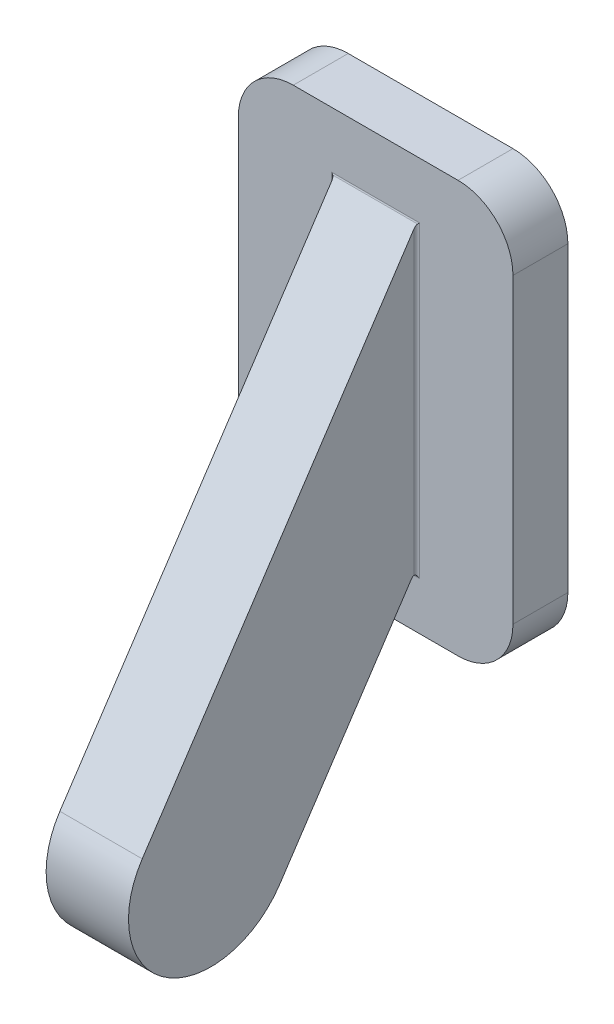
ISO-10303-21;
HEADER;
FILE_DESCRIPTION(('STEP AP214'),'2;1');
FILE_NAME('part.step','',(''),(''),'','','');
FILE_SCHEMA(('AUTOMOTIVE_DESIGN { 1 0 10303 214 1 1 1 1 }'));
ENDSEC;
DATA;
#1=APPLICATION_CONTEXT('core data for automotive mechanical design processes');
#2=APPLICATION_PROTOCOL_DEFINITION('international standard','automotive_design',2000,#1);
#3=PRODUCT_CONTEXT('',#1,'mechanical');
#4=PRODUCT('Part','Part','',(#3));
#5=PRODUCT_RELATED_PRODUCT_CATEGORY('part','',(#4));
#6=PRODUCT_DEFINITION_FORMATION('','',#4);
#7=PRODUCT_DEFINITION_CONTEXT('part definition',#1,'design');
#8=PRODUCT_DEFINITION('design','',#6,#7);
#9=PRODUCT_DEFINITION_SHAPE('','',#8);
#10=(LENGTH_UNIT() NAMED_UNIT(*) SI_UNIT(.MILLI.,.METRE.));
#11=(NAMED_UNIT(*) PLANE_ANGLE_UNIT() SI_UNIT($,.RADIAN.));
#12=(NAMED_UNIT(*) SI_UNIT($,.STERADIAN.) SOLID_ANGLE_UNIT());
#13=UNCERTAINTY_MEASURE_WITH_UNIT(LENGTH_MEASURE(1.E-05),#10,'distance_accuracy_value','');
#14=(GEOMETRIC_REPRESENTATION_CONTEXT(3) GLOBAL_UNCERTAINTY_ASSIGNED_CONTEXT((#13)) GLOBAL_UNIT_ASSIGNED_CONTEXT((#10,
#11,#12)) REPRESENTATION_CONTEXT('',''));
#15=CARTESIAN_POINT('',(0.,0.,0.));
#16=DIRECTION('',(0.,0.,1.));
#17=DIRECTION('',(1.,0.,0.));
#18=AXIS2_PLACEMENT_3D('',#15,#16,#17);
#19=CARTESIAN_POINT('',(5.,-7.5,2.));
#20=DIRECTION('',(-1.,0.,0.));
#21=DIRECTION('',(0.,0.,1.));
#22=AXIS2_PLACEMENT_3D('',#19,#20,#21);
#23=PLANE('',#22);
#24=DIRECTION('',(0.,1.,0.));
#25=VECTOR('',#24,1.);
#26=CARTESIAN_POINT('',(5.,-7.5,0.));
#27=LINE('',#26,#25);
#28=CARTESIAN_POINT('',(5.,-5.5,0.));
#29=VERTEX_POINT('',#28);
#30=CARTESIAN_POINT('',(5.,5.5,0.));
#31=VERTEX_POINT('',#30);
#32=EDGE_CURVE('E174',#29,#31,#27,.T.);
#33=ORIENTED_EDGE('',*,*,#32,.T.);
#34=DIRECTION('',(0.,0.,-1.));
#35=VECTOR('',#34,1.);
#36=CARTESIAN_POINT('',(5.,5.5,2.));
#37=LINE('',#36,#35);
#38=CARTESIAN_POINT('',(5.,5.5,2.));
#39=VERTEX_POINT('',#38);
#40=EDGE_CURVE('E269',#31,#39,#37,.F.);
#41=ORIENTED_EDGE('',*,*,#40,.T.);
#42=DIRECTION('',(0.,1.,0.));
#43=VECTOR('',#42,1.);
#44=CARTESIAN_POINT('',(5.,-7.5,2.));
#45=LINE('',#44,#43);
#46=CARTESIAN_POINT('',(5.,-5.5,2.));
#47=VERTEX_POINT('',#46);
#48=EDGE_CURVE('E196',#47,#39,#45,.T.);
#49=ORIENTED_EDGE('',*,*,#48,.F.);
#50=DIRECTION('',(0.,0.,-1.));
#51=VECTOR('',#50,1.);
#52=CARTESIAN_POINT('',(5.,-5.5,2.));
#53=LINE('',#52,#51);
#54=EDGE_CURVE('E265',#47,#29,#53,.T.);
#55=ORIENTED_EDGE('',*,*,#54,.T.);
#56=EDGE_LOOP('',(#33,#41,#49,#55));
#57=FACE_BOUND('',#56,.T.);
#58=ADVANCED_FACE('F39',(#57),#23,.F.);
#59=CARTESIAN_POINT('',(-5.,7.5,2.));
#60=DIRECTION('',(0.,-1.,0.));
#61=DIRECTION('',(0.,0.,-1.));
#62=AXIS2_PLACEMENT_3D('',#59,#60,#61);
#63=PLANE('',#62);
#64=DIRECTION('',(-1.,0.,0.));
#65=VECTOR('',#64,1.);
#66=CARTESIAN_POINT('',(-5.,7.5,0.));
#67=LINE('',#66,#65);
#68=CARTESIAN_POINT('',(3.,7.5,0.));
#69=VERTEX_POINT('',#68);
#70=CARTESIAN_POINT('',(-3.,7.5,0.));
#71=VERTEX_POINT('',#70);
#72=EDGE_CURVE('E217',#69,#71,#67,.T.);
#73=ORIENTED_EDGE('',*,*,#72,.T.);
#74=DIRECTION('',(0.,0.,-1.));
#75=VECTOR('',#74,1.);
#76=CARTESIAN_POINT('',(-3.,7.5,2.));
#77=LINE('',#76,#75);
#78=CARTESIAN_POINT('',(-3.,7.5,2.));
#79=VERTEX_POINT('',#78);
#80=EDGE_CURVE('E250',#71,#79,#77,.F.);
#81=ORIENTED_EDGE('',*,*,#80,.T.);
#82=DIRECTION('',(-1.,0.,0.));
#83=VECTOR('',#82,1.);
#84=CARTESIAN_POINT('',(-5.,7.5,2.));
#85=LINE('',#84,#83);
#86=CARTESIAN_POINT('',(3.,7.5,2.));
#87=VERTEX_POINT('',#86);
#88=EDGE_CURVE('E200',#87,#79,#85,.T.);
#89=ORIENTED_EDGE('',*,*,#88,.F.);
#90=DIRECTION('',(0.,0.,-1.));
#91=VECTOR('',#90,1.);
#92=CARTESIAN_POINT('',(3.,7.5,2.));
#93=LINE('',#92,#91);
#94=EDGE_CURVE('E246',#87,#69,#93,.T.);
#95=ORIENTED_EDGE('',*,*,#94,.T.);
#96=EDGE_LOOP('',(#73,#81,#89,#95));
#97=FACE_BOUND('',#96,.T.);
#98=ADVANCED_FACE('F354',(#97),#63,.F.);
#99=CARTESIAN_POINT('',(-5.,-7.5,2.));
#100=DIRECTION('',(1.,0.,0.));
#101=DIRECTION('',(0.,0.,-1.));
#102=AXIS2_PLACEMENT_3D('',#99,#100,#101);
#103=PLANE('',#102);
#104=DIRECTION('',(0.,-1.,0.));
#105=VECTOR('',#104,1.);
#106=CARTESIAN_POINT('',(-5.,-7.5,2.));
#107=LINE('',#106,#105);
#108=CARTESIAN_POINT('',(-5.,5.5,2.));
#109=VERTEX_POINT('',#108);
#110=CARTESIAN_POINT('',(-5.,-5.5,2.));
#111=VERTEX_POINT('',#110);
#112=EDGE_CURVE('E205',#109,#111,#107,.T.);
#113=ORIENTED_EDGE('',*,*,#112,.F.);
#114=DIRECTION('',(0.,0.,-1.));
#115=VECTOR('',#114,1.);
#116=CARTESIAN_POINT('',(-5.,5.5,2.));
#117=LINE('',#116,#115);
#118=CARTESIAN_POINT('',(-5.,5.5,0.));
#119=VERTEX_POINT('',#118);
#120=EDGE_CURVE('E230',#109,#119,#117,.T.);
#121=ORIENTED_EDGE('',*,*,#120,.T.);
#122=DIRECTION('',(0.,-1.,0.));
#123=VECTOR('',#122,1.);
#124=CARTESIAN_POINT('',(-5.,-7.5,0.));
#125=LINE('',#124,#123);
#126=CARTESIAN_POINT('',(-5.,-5.5,0.));
#127=VERTEX_POINT('',#126);
#128=EDGE_CURVE('E221',#119,#127,#125,.T.);
#129=ORIENTED_EDGE('',*,*,#128,.T.);
#130=DIRECTION('',(0.,0.,-1.));
#131=VECTOR('',#130,1.);
#132=CARTESIAN_POINT('',(-5.,-5.5,2.));
#133=LINE('',#132,#131);
#134=EDGE_CURVE('E213',#127,#111,#133,.F.);
#135=ORIENTED_EDGE('',*,*,#134,.T.);
#136=EDGE_LOOP('',(#113,#121,#129,#135));
#137=FACE_BOUND('',#136,.T.);
#138=ADVANCED_FACE('F360',(#137),#103,.F.);
#139=CARTESIAN_POINT('',(-5.,-7.5,2.));
#140=DIRECTION('',(0.,1.,0.));
#141=DIRECTION('',(0.,0.,1.));
#142=AXIS2_PLACEMENT_3D('',#139,#140,#141);
#143=PLANE('',#142);
#144=DIRECTION('',(1.,0.,0.));
#145=VECTOR('',#144,1.);
#146=CARTESIAN_POINT('',(-5.,-7.5,0.));
#147=LINE('',#146,#145);
#148=CARTESIAN_POINT('',(-3.,-7.5,0.));
#149=VERTEX_POINT('',#148);
#150=CARTESIAN_POINT('',(3.,-7.5,0.));
#151=VERTEX_POINT('',#150);
#152=EDGE_CURVE('E201',#149,#151,#147,.T.);
#153=ORIENTED_EDGE('',*,*,#152,.T.);
#154=DIRECTION('',(0.,0.,-1.));
#155=VECTOR('',#154,1.);
#156=CARTESIAN_POINT('',(3.,-7.5,2.));
#157=LINE('',#156,#155);
#158=CARTESIAN_POINT('',(3.,-7.5,2.));
#159=VERTEX_POINT('',#158);
#160=EDGE_CURVE('E276',#151,#159,#157,.F.);
#161=ORIENTED_EDGE('',*,*,#160,.T.);
#162=DIRECTION('',(1.,0.,0.));
#163=VECTOR('',#162,1.);
#164=CARTESIAN_POINT('',(-5.,-7.5,2.));
#165=LINE('',#164,#163);
#166=CARTESIAN_POINT('',(-3.,-7.5,2.));
#167=VERTEX_POINT('',#166);
#168=EDGE_CURVE('E209',#167,#159,#165,.T.);
#169=ORIENTED_EDGE('',*,*,#168,.F.);
#170=DIRECTION('',(0.,0.,-1.));
#171=VECTOR('',#170,1.);
#172=CARTESIAN_POINT('',(-3.,-7.5,2.));
#173=LINE('',#172,#171);
#174=EDGE_CURVE('E272',#167,#149,#173,.T.);
#175=ORIENTED_EDGE('',*,*,#174,.T.);
#176=EDGE_LOOP('',(#153,#161,#169,#175));
#177=FACE_BOUND('',#176,.T.);
#178=ADVANCED_FACE('F440',(#177),#143,.F.);
#179=CARTESIAN_POINT('',(0.,0.,2.));
#180=DIRECTION('',(0.,0.,-1.));
#181=DIRECTION('',(-1.,0.,0.));
#182=AXIS2_PLACEMENT_3D('',#179,#180,#181);
#183=PLANE('',#182);
#184=DIRECTION('',(-1.,0.,0.));
#185=VECTOR('',#184,1.);
#186=CARTESIAN_POINT('',(-1.5,-5.75886668143528,2.));
#187=LINE('',#186,#185);
#188=CARTESIAN_POINT('',(1.6,-5.75886668143528,2.));
#189=VERTEX_POINT('',#188);
#190=CARTESIAN_POINT('',(-1.6,-5.75886668143528,2.));
#191=VERTEX_POINT('',#190);
#192=EDGE_CURVE('E285',#189,#191,#187,.T.);
#193=ORIENTED_EDGE('',*,*,#192,.T.);
#194=DIRECTION('',(0.,1.,0.));
#195=VECTOR('',#194,1.);
#196=CARTESIAN_POINT('',(-1.6,5.42720420239974,2.));
#197=LINE('',#196,#195);
#198=CARTESIAN_POINT('',(-1.6,5.45735533685752,2.));
#199=VERTEX_POINT('',#198);
#200=EDGE_CURVE('E288',#191,#199,#197,.T.);
#201=ORIENTED_EDGE('',*,*,#200,.T.);
#202=DIRECTION('',(-1.,0.,0.));
#203=VECTOR('',#202,1.);
#204=CARTESIAN_POINT('',(1.5,5.45735533685752,2.));
#205=LINE('',#204,#203);
#206=CARTESIAN_POINT('',(1.6,5.45735533685752,2.));
#207=VERTEX_POINT('',#206);
#208=EDGE_CURVE('E282',#199,#207,#205,.F.);
#209=ORIENTED_EDGE('',*,*,#208,.T.);
#210=DIRECTION('',(0.,1.,0.));
#211=VECTOR('',#210,1.);
#212=CARTESIAN_POINT('',(1.6,0.,2.));
#213=LINE('',#212,#211);
#214=EDGE_CURVE('E279',#207,#189,#213,.F.);
#215=ORIENTED_EDGE('',*,*,#214,.T.);
#216=EDGE_LOOP('',(#193,#201,#209,#215));
#217=FACE_BOUND('',#216,.T.);
#218=ORIENTED_EDGE('',*,*,#88,.T.);
#219=CARTESIAN_POINT('',(-3.,5.5,2.));
#220=DIRECTION('',(0.,0.,-1.));
#221=DIRECTION('',(-1.,0.,0.));
#222=AXIS2_PLACEMENT_3D('',#219,#220,#221);
#223=CIRCLE('',#222,2.);
#224=EDGE_CURVE('E262',#79,#109,#223,.F.);
#225=ORIENTED_EDGE('',*,*,#224,.T.);
#226=ORIENTED_EDGE('',*,*,#112,.T.);
#227=CARTESIAN_POINT('',(-3.,-5.5,2.));
#228=DIRECTION('',(0.,0.,-1.));
#229=DIRECTION('',(-1.,0.,0.));
#230=AXIS2_PLACEMENT_3D('',#227,#228,#229);
#231=CIRCLE('',#230,2.);
#232=EDGE_CURVE('E253',#111,#167,#231,.F.);
#233=ORIENTED_EDGE('',*,*,#232,.T.);
#234=ORIENTED_EDGE('',*,*,#168,.T.);
#235=CARTESIAN_POINT('',(3.,-5.5,2.));
#236=DIRECTION('',(0.,0.,-1.));
#237=DIRECTION('',(-1.,0.,0.));
#238=AXIS2_PLACEMENT_3D('',#235,#236,#237);
#239=CIRCLE('',#238,2.);
#240=EDGE_CURVE('E256',#159,#47,#239,.F.);
#241=ORIENTED_EDGE('',*,*,#240,.T.);
#242=ORIENTED_EDGE('',*,*,#48,.T.);
#243=CARTESIAN_POINT('',(3.,5.5,2.));
#244=DIRECTION('',(0.,0.,-1.));
#245=DIRECTION('',(-1.,0.,0.));
#246=AXIS2_PLACEMENT_3D('',#243,#244,#245);
#247=CIRCLE('',#246,2.);
#248=EDGE_CURVE('E259',#39,#87,#247,.F.);
#249=ORIENTED_EDGE('',*,*,#248,.T.);
#250=EDGE_LOOP('',(#218,#225,#226,#233,#234,#241,#242,#249));
#251=FACE_BOUND('',#250,.T.);
#252=ADVANCED_FACE('F330',(#217,#251),#183,.F.);
#253=CARTESIAN_POINT('',(0.,0.,0.));
#254=DIRECTION('',(0.,0.,-1.));
#255=DIRECTION('',(-1.,0.,0.));
#256=AXIS2_PLACEMENT_3D('',#253,#254,#255);
#257=PLANE('',#256);
#258=ORIENTED_EDGE('',*,*,#128,.F.);
#259=CARTESIAN_POINT('',(-3.,5.5,0.));
#260=DIRECTION('',(0.,0.,-1.));
#261=DIRECTION('',(-1.,0.,0.));
#262=AXIS2_PLACEMENT_3D('',#259,#260,#261);
#263=CIRCLE('',#262,2.);
#264=EDGE_CURVE('E243',#119,#71,#263,.T.);
#265=ORIENTED_EDGE('',*,*,#264,.T.);
#266=ORIENTED_EDGE('',*,*,#72,.F.);
#267=CARTESIAN_POINT('',(3.,5.5,0.));
#268=DIRECTION('',(0.,0.,-1.));
#269=DIRECTION('',(-1.,0.,0.));
#270=AXIS2_PLACEMENT_3D('',#267,#268,#269);
#271=CIRCLE('',#270,2.);
#272=EDGE_CURVE('E240',#69,#31,#271,.T.);
#273=ORIENTED_EDGE('',*,*,#272,.T.);
#274=ORIENTED_EDGE('',*,*,#32,.F.);
#275=CARTESIAN_POINT('',(3.,-5.5,0.));
#276=DIRECTION('',(0.,0.,-1.));
#277=DIRECTION('',(-1.,0.,0.));
#278=AXIS2_PLACEMENT_3D('',#275,#276,#277);
#279=CIRCLE('',#278,2.);
#280=EDGE_CURVE('E237',#29,#151,#279,.T.);
#281=ORIENTED_EDGE('',*,*,#280,.T.);
#282=ORIENTED_EDGE('',*,*,#152,.F.);
#283=CARTESIAN_POINT('',(-3.,-5.5,0.));
#284=DIRECTION('',(0.,0.,-1.));
#285=DIRECTION('',(-1.,0.,0.));
#286=AXIS2_PLACEMENT_3D('',#283,#284,#285);
#287=CIRCLE('',#286,2.);
#288=EDGE_CURVE('E234',#149,#127,#287,.T.);
#289=ORIENTED_EDGE('',*,*,#288,.T.);
#290=EDGE_LOOP('',(#258,#265,#266,#273,#274,#281,#282,#289));
#291=FACE_BOUND('',#290,.T.);
#292=ADVANCED_FACE('F430',(#291),#257,.T.);
#293=CARTESIAN_POINT('',(1.5,5.42720420239974,2.));
#294=DIRECTION('',(0.,-0.552770798392567,-0.833333333333333));
#295=DIRECTION('',(0.,0.833333333333333,-0.552770798392567));
#296=AXIS2_PLACEMENT_3D('',#293,#294,#295);
#297=PLANE('',#296);
#298=DIRECTION('',(0.,-0.833333333333333,0.552770798392567));
#299=VECTOR('',#298,1.);
#300=CARTESIAN_POINT('',(1.5,5.42720420239974,2.));
#301=LINE('',#300,#299);
#302=CARTESIAN_POINT('',(1.5,5.27644853011086,2.1));
#303=VERTEX_POINT('',#302);
#304=CARTESIAN_POINT('',(1.5,-9.64836302648842,12.));
#305=VERTEX_POINT('',#304);
#306=EDGE_CURVE('E155',#303,#305,#301,.T.);
#307=ORIENTED_EDGE('',*,*,#306,.F.);
#308=CARTESIAN_POINT('',(1.6,5.27644853011086,2.1));
#309=DIRECTION('',(0.,-0.552770798392567,-0.833333333333333));
#310=DIRECTION('',(0.,0.833333333333333,-0.552770798392567));
#311=AXIS2_PLACEMENT_3D('',#308,#309,#310);
#312=ELLIPSE('',#311,0.180906806746658,0.1);
#313=CARTESIAN_POINT('',(1.54472292016056,5.40207825701826,2.01666666666667));
#314=VERTEX_POINT('',#313);
#315=EDGE_CURVE('E11',#303,#314,#312,.T.);
#316=ORIENTED_EDGE('',*,*,#315,.T.);
#317=DIRECTION('',(-1.,0.,0.));
#318=VECTOR('',#317,1.);
#319=CARTESIAN_POINT('',(-1.5,5.40207825701826,2.01666666666667));
#320=LINE('',#319,#318);
#321=CARTESIAN_POINT('',(-1.54472292016056,5.40207825701826,2.01666666666667));
#322=VERTEX_POINT('',#321);
#323=EDGE_CURVE('E57',#314,#322,#320,.T.);
#324=ORIENTED_EDGE('',*,*,#323,.T.);
#325=CARTESIAN_POINT('',(-1.6,5.27644853011086,2.1));
#326=DIRECTION('',(0.,-0.552770798392567,-0.833333333333333));
#327=DIRECTION('',(0.,-0.833333333333333,0.552770798392567));
#328=AXIS2_PLACEMENT_3D('',#325,#326,#327);
#329=ELLIPSE('',#328,0.180906806746658,0.1);
#330=CARTESIAN_POINT('',(-1.5,5.27644853011086,2.1));
#331=VERTEX_POINT('',#330);
#332=EDGE_CURVE('E302',#322,#331,#329,.T.);
#333=ORIENTED_EDGE('',*,*,#332,.T.);
#334=DIRECTION('',(0.,-0.833333333333333,0.552770798392567));
#335=VECTOR('',#334,1.);
#336=CARTESIAN_POINT('',(-1.5,5.42720420239974,2.));
#337=LINE('',#336,#335);
#338=CARTESIAN_POINT('',(-1.5,-9.64836302648842,12.));
#339=VERTEX_POINT('',#338);
#340=EDGE_CURVE('E170',#331,#339,#337,.T.);
#341=ORIENTED_EDGE('',*,*,#340,.T.);
#342=DIRECTION('',(-1.,0.,0.));
#343=VECTOR('',#342,1.);
#344=CARTESIAN_POINT('',(1.5,-9.64836302648842,12.));
#345=LINE('',#344,#343);
#346=EDGE_CURVE('E167',#305,#339,#345,.T.);
#347=ORIENTED_EDGE('',*,*,#346,.F.);
#348=EDGE_LOOP('',(#307,#316,#324,#333,#341,#347));
#349=FACE_BOUND('',#348,.T.);
#350=ADVANCED_FACE('F168',(#349),#297,.F.);
#351=CARTESIAN_POINT('',(1.5,-11.3066754216661,9.5));
#352=DIRECTION('',(-1.,0.,0.));
#353=DIRECTION('',(0.,0.,1.));
#354=AXIS2_PLACEMENT_3D('',#351,#352,#353);
#355=CYLINDRICAL_SURFACE('',#354,3.);
#356=CARTESIAN_POINT('',(-1.5,-11.3066754216661,9.5));
#357=DIRECTION('',(1.,0.,0.));
#358=DIRECTION('',(0.,0.,-1.));
#359=AXIS2_PLACEMENT_3D('',#356,#357,#358);
#360=CIRCLE('',#359,3.);
#361=CARTESIAN_POINT('',(-1.5,-12.9649878168438,7.));
#362=VERTEX_POINT('',#361);
#363=EDGE_CURVE('E188',#339,#362,#360,.T.);
#364=ORIENTED_EDGE('',*,*,#363,.T.);
#365=DIRECTION('',(-1.,0.,0.));
#366=VECTOR('',#365,1.);
#367=CARTESIAN_POINT('',(1.5,-12.9649878168438,7.));
#368=LINE('',#367,#366);
#369=CARTESIAN_POINT('',(1.5,-12.9649878168438,7.));
#370=VERTEX_POINT('',#369);
#371=EDGE_CURVE('E175',#370,#362,#368,.T.);
#372=ORIENTED_EDGE('',*,*,#371,.F.);
#373=CARTESIAN_POINT('',(1.5,-11.3066754216661,9.5));
#374=DIRECTION('',(1.,0.,0.));
#375=DIRECTION('',(0.,0.,-1.));
#376=AXIS2_PLACEMENT_3D('',#373,#374,#375);
#377=CIRCLE('',#376,3.);
#378=EDGE_CURVE('E160',#305,#370,#377,.T.);
#379=ORIENTED_EDGE('',*,*,#378,.F.);
#380=ORIENTED_EDGE('',*,*,#346,.T.);
#381=EDGE_LOOP('',(#364,#372,#379,#380));
#382=FACE_BOUND('',#381,.T.);
#383=ADVANCED_FACE('F177',(#382),#355,.T.);
#384=CARTESIAN_POINT('',(1.5,-12.9649878168438,7.));
#385=DIRECTION('',(0.,0.552770798392567,0.833333333333333));
#386=DIRECTION('',(0.,-0.833333333333333,0.552770798392567));
#387=AXIS2_PLACEMENT_3D('',#384,#385,#386);
#388=PLANE('',#387);
#389=DIRECTION('',(0.,0.833333333333333,-0.552770798392567));
#390=VECTOR('',#389,1.);
#391=CARTESIAN_POINT('',(-1.5,-12.9649878168438,7.));
#392=LINE('',#391,#390);
#393=CARTESIAN_POINT('',(-1.5,-5.70358960159602,2.18333333333333));
#394=VERTEX_POINT('',#393);
#395=EDGE_CURVE('E164',#362,#394,#392,.T.);
#396=ORIENTED_EDGE('',*,*,#395,.T.);
#397=DIRECTION('',(-1.,0.,0.));
#398=VECTOR('',#397,1.);
#399=CARTESIAN_POINT('',(1.5,-5.70358960159602,2.18333333333333));
#400=LINE('',#399,#398);
#401=CARTESIAN_POINT('',(1.5,-5.70358960159602,2.18333333333333));
#402=VERTEX_POINT('',#401);
#403=EDGE_CURVE('E295',#394,#402,#400,.F.);
#404=ORIENTED_EDGE('',*,*,#403,.T.);
#405=DIRECTION('',(0.,0.833333333333333,-0.552770798392567));
#406=VECTOR('',#405,1.);
#407=CARTESIAN_POINT('',(1.5,-12.9649878168438,7.));
#408=LINE('',#407,#406);
#409=EDGE_CURVE('E181',#370,#402,#408,.T.);
#410=ORIENTED_EDGE('',*,*,#409,.F.);
#411=ORIENTED_EDGE('',*,*,#371,.T.);
#412=EDGE_LOOP('',(#396,#404,#410,#411));
#413=FACE_BOUND('',#412,.T.);
#414=ADVANCED_FACE('F343',(#413),#388,.F.);
#415=CARTESIAN_POINT('',(1.5,-11.3066754216661,9.5));
#416=DIRECTION('',(1.,0.,0.));
#417=DIRECTION('',(0.,0.,-1.));
#418=AXIS2_PLACEMENT_3D('',#415,#416,#417);
#419=PLANE('',#418);
#420=CARTESIAN_POINT('',(1.5,-5.75886668143528,2.1));
#421=DIRECTION('',(1.,0.,0.));
#422=DIRECTION('',(0.,0.,-1.));
#423=AXIS2_PLACEMENT_3D('',#420,#421,#422);
#424=CIRCLE('',#423,0.1);
#425=CARTESIAN_POINT('',(1.5,-5.65886668143528,2.1));
#426=VERTEX_POINT('',#425);
#427=EDGE_CURVE('E49',#402,#426,#424,.F.);
#428=ORIENTED_EDGE('',*,*,#427,.T.);
#429=DIRECTION('',(0.,1.,0.));
#430=VECTOR('',#429,1.);
#431=CARTESIAN_POINT('',(1.5,-11.3066754216661,2.1));
#432=LINE('',#431,#430);
#433=EDGE_CURVE('E64',#426,#303,#432,.T.);
#434=ORIENTED_EDGE('',*,*,#433,.T.);
#435=ORIENTED_EDGE('',*,*,#306,.T.);
#436=ORIENTED_EDGE('',*,*,#378,.T.);
#437=ORIENTED_EDGE('',*,*,#409,.T.);
#438=EDGE_LOOP('',(#428,#434,#435,#436,#437));
#439=FACE_BOUND('',#438,.T.);
#440=ADVANCED_FACE('F157',(#439),#419,.T.);
#441=CARTESIAN_POINT('',(-1.5,-11.3066754216661,9.5));
#442=DIRECTION('',(1.,0.,0.));
#443=DIRECTION('',(0.,0.,-1.));
#444=AXIS2_PLACEMENT_3D('',#441,#442,#443);
#445=PLANE('',#444);
#446=ORIENTED_EDGE('',*,*,#340,.F.);
#447=DIRECTION('',(0.,1.,0.));
#448=VECTOR('',#447,1.);
#449=CARTESIAN_POINT('',(-1.5,-5.42720420239974,2.1));
#450=LINE('',#449,#448);
#451=CARTESIAN_POINT('',(-1.5,-5.65886668143528,2.1));
#452=VERTEX_POINT('',#451);
#453=EDGE_CURVE('E292',#331,#452,#450,.F.);
#454=ORIENTED_EDGE('',*,*,#453,.T.);
#455=CARTESIAN_POINT('',(-1.5,-5.75886668143528,2.1));
#456=DIRECTION('',(1.,0.,0.));
#457=DIRECTION('',(0.,0.,-1.));
#458=AXIS2_PLACEMENT_3D('',#455,#456,#457);
#459=CIRCLE('',#458,0.1);
#460=EDGE_CURVE('E305',#452,#394,#459,.T.);
#461=ORIENTED_EDGE('',*,*,#460,.T.);
#462=ORIENTED_EDGE('',*,*,#395,.F.);
#463=ORIENTED_EDGE('',*,*,#363,.F.);
#464=EDGE_LOOP('',(#446,#454,#461,#462,#463));
#465=FACE_BOUND('',#464,.T.);
#466=ADVANCED_FACE('F339',(#465),#445,.F.);
#467=CARTESIAN_POINT('',(-3.,5.5,2.));
#468=DIRECTION('',(0.,0.,-1.));
#469=DIRECTION('',(-1.,0.,0.));
#470=AXIS2_PLACEMENT_3D('',#467,#468,#469);
#471=CYLINDRICAL_SURFACE('',#470,2.);
#472=ORIENTED_EDGE('',*,*,#224,.F.);
#473=ORIENTED_EDGE('',*,*,#80,.F.);
#474=ORIENTED_EDGE('',*,*,#264,.F.);
#475=ORIENTED_EDGE('',*,*,#120,.F.);
#476=EDGE_LOOP('',(#472,#473,#474,#475));
#477=FACE_BOUND('',#476,.T.);
#478=ADVANCED_FACE('F365',(#477),#471,.T.);
#479=CARTESIAN_POINT('',(3.,5.5,2.));
#480=DIRECTION('',(0.,0.,-1.));
#481=DIRECTION('',(-1.,0.,0.));
#482=AXIS2_PLACEMENT_3D('',#479,#480,#481);
#483=CYLINDRICAL_SURFACE('',#482,2.);
#484=ORIENTED_EDGE('',*,*,#248,.F.);
#485=ORIENTED_EDGE('',*,*,#40,.F.);
#486=ORIENTED_EDGE('',*,*,#272,.F.);
#487=ORIENTED_EDGE('',*,*,#94,.F.);
#488=EDGE_LOOP('',(#484,#485,#486,#487));
#489=FACE_BOUND('',#488,.T.);
#490=ADVANCED_FACE('F368',(#489),#483,.T.);
#491=CARTESIAN_POINT('',(3.,-5.5,2.));
#492=DIRECTION('',(0.,0.,-1.));
#493=DIRECTION('',(-1.,0.,0.));
#494=AXIS2_PLACEMENT_3D('',#491,#492,#493);
#495=CYLINDRICAL_SURFACE('',#494,2.);
#496=ORIENTED_EDGE('',*,*,#240,.F.);
#497=ORIENTED_EDGE('',*,*,#160,.F.);
#498=ORIENTED_EDGE('',*,*,#280,.F.);
#499=ORIENTED_EDGE('',*,*,#54,.F.);
#500=EDGE_LOOP('',(#496,#497,#498,#499));
#501=FACE_BOUND('',#500,.T.);
#502=ADVANCED_FACE('F372',(#501),#495,.T.);
#503=CARTESIAN_POINT('',(-3.,-5.5,2.));
#504=DIRECTION('',(0.,0.,-1.));
#505=DIRECTION('',(-1.,0.,0.));
#506=AXIS2_PLACEMENT_3D('',#503,#504,#505);
#507=CYLINDRICAL_SURFACE('',#506,2.);
#508=ORIENTED_EDGE('',*,*,#232,.F.);
#509=ORIENTED_EDGE('',*,*,#134,.F.);
#510=ORIENTED_EDGE('',*,*,#288,.F.);
#511=ORIENTED_EDGE('',*,*,#174,.F.);
#512=EDGE_LOOP('',(#508,#509,#510,#511));
#513=FACE_BOUND('',#512,.T.);
#514=ADVANCED_FACE('F376',(#513),#507,.T.);
#515=CARTESIAN_POINT('',(1.6,-11.3066754216661,2.1));
#516=DIRECTION('',(0.,1.,0.));
#517=DIRECTION('',(0.,0.,1.));
#518=AXIS2_PLACEMENT_3D('',#515,#516,#517);
#519=CYLINDRICAL_SURFACE('',#518,0.1);
#520=ORIENTED_EDGE('',*,*,#433,.F.);
#521=CARTESIAN_POINT('',(1.6,-5.75886668143528,2.1));
#522=DIRECTION('',(0.707106781186547,0.707106781186547,0.));
#523=DIRECTION('',(-0.707106781186547,0.707106781186547,0.));
#524=AXIS2_PLACEMENT_3D('',#521,#522,#523);
#525=ELLIPSE('',#524,0.14142135623731,0.1);
#526=EDGE_CURVE('E43',#189,#426,#525,.T.);
#527=ORIENTED_EDGE('',*,*,#526,.F.);
#528=ORIENTED_EDGE('',*,*,#214,.F.);
#529=CARTESIAN_POINT('',(1.6,5.45735533685752,2.1));
#530=DIRECTION('',(-0.707106781186547,0.707106781186547,0.));
#531=DIRECTION('',(0.707106781186547,0.707106781186547,0.));
#532=AXIS2_PLACEMENT_3D('',#529,#530,#531);
#533=ELLIPSE('',#532,0.14142135623731,0.1);
#534=EDGE_CURVE('E316',#314,#207,#533,.F.);
#535=ORIENTED_EDGE('',*,*,#534,.F.);
#536=ORIENTED_EDGE('',*,*,#315,.F.);
#537=EDGE_LOOP('',(#520,#527,#528,#535,#536));
#538=FACE_BOUND('',#537,.T.);
#539=ADVANCED_FACE('F41',(#538),#519,.F.);
#540=CARTESIAN_POINT('',(0.,-5.75886668143528,2.1));
#541=DIRECTION('',(1.,0.,0.));
#542=DIRECTION('',(0.,0.,-1.));
#543=AXIS2_PLACEMENT_3D('',#540,#541,#542);
#544=CYLINDRICAL_SURFACE('',#543,0.1);
#545=ORIENTED_EDGE('',*,*,#403,.F.);
#546=ORIENTED_EDGE('',*,*,#460,.F.);
#547=CARTESIAN_POINT('',(-1.6,-5.75886668143528,2.1));
#548=DIRECTION('',(0.707106781186547,-0.707106781186547,0.));
#549=DIRECTION('',(0.707106781186547,0.707106781186547,0.));
#550=AXIS2_PLACEMENT_3D('',#547,#548,#549);
#551=ELLIPSE('',#550,0.14142135623731,0.1);
#552=EDGE_CURVE('E313',#191,#452,#551,.T.);
#553=ORIENTED_EDGE('',*,*,#552,.F.);
#554=ORIENTED_EDGE('',*,*,#192,.F.);
#555=ORIENTED_EDGE('',*,*,#526,.T.);
#556=ORIENTED_EDGE('',*,*,#427,.F.);
#557=EDGE_LOOP('',(#545,#546,#553,#554,#555,#556));
#558=FACE_BOUND('',#557,.T.);
#559=ADVANCED_FACE('F326',(#558),#544,.F.);
#560=CARTESIAN_POINT('',(1.5,5.45735533685752,2.1));
#561=DIRECTION('',(1.,0.,0.));
#562=DIRECTION('',(0.,0.,-1.));
#563=AXIS2_PLACEMENT_3D('',#560,#561,#562);
#564=CYLINDRICAL_SURFACE('',#563,0.1);
#565=ORIENTED_EDGE('',*,*,#534,.T.);
#566=ORIENTED_EDGE('',*,*,#208,.F.);
#567=CARTESIAN_POINT('',(-1.6,5.45735533685752,2.1));
#568=DIRECTION('',(0.707106781186547,0.707106781186547,0.));
#569=DIRECTION('',(0.707106781186547,-0.707106781186547,0.));
#570=AXIS2_PLACEMENT_3D('',#567,#568,#569);
#571=ELLIPSE('',#570,0.14142135623731,0.1);
#572=EDGE_CURVE('E310',#322,#199,#571,.T.);
#573=ORIENTED_EDGE('',*,*,#572,.F.);
#574=ORIENTED_EDGE('',*,*,#323,.F.);
#575=EDGE_LOOP('',(#565,#566,#573,#574));
#576=FACE_BOUND('',#575,.T.);
#577=ADVANCED_FACE('F333',(#576),#564,.F.);
#578=CARTESIAN_POINT('',(-1.6,0.,2.1));
#579=DIRECTION('',(0.,-1.,0.));
#580=DIRECTION('',(0.,0.,-1.));
#581=AXIS2_PLACEMENT_3D('',#578,#579,#580);
#582=CYLINDRICAL_SURFACE('',#581,0.1);
#583=ORIENTED_EDGE('',*,*,#552,.T.);
#584=ORIENTED_EDGE('',*,*,#453,.F.);
#585=ORIENTED_EDGE('',*,*,#332,.F.);
#586=ORIENTED_EDGE('',*,*,#572,.T.);
#587=ORIENTED_EDGE('',*,*,#200,.F.);
#588=EDGE_LOOP('',(#583,#584,#585,#586,#587));
#589=FACE_BOUND('',#588,.T.);
#590=ADVANCED_FACE('F337',(#589),#582,.F.);
#591=CLOSED_SHELL('',(#58,#98,#138,#178,#252,#292,#350,#383,#414,#440,#466,#478,#490,#502,#514,
#539,#559,#577,#590));
#592=MANIFOLD_SOLID_BREP('B2',#591);
#593=ADVANCED_BREP_SHAPE_REPRESENTATION('',(#18,#592),#14);
#594=SHAPE_DEFINITION_REPRESENTATION(#9,#593);
ENDSEC;
END-ISO-10303-21;
